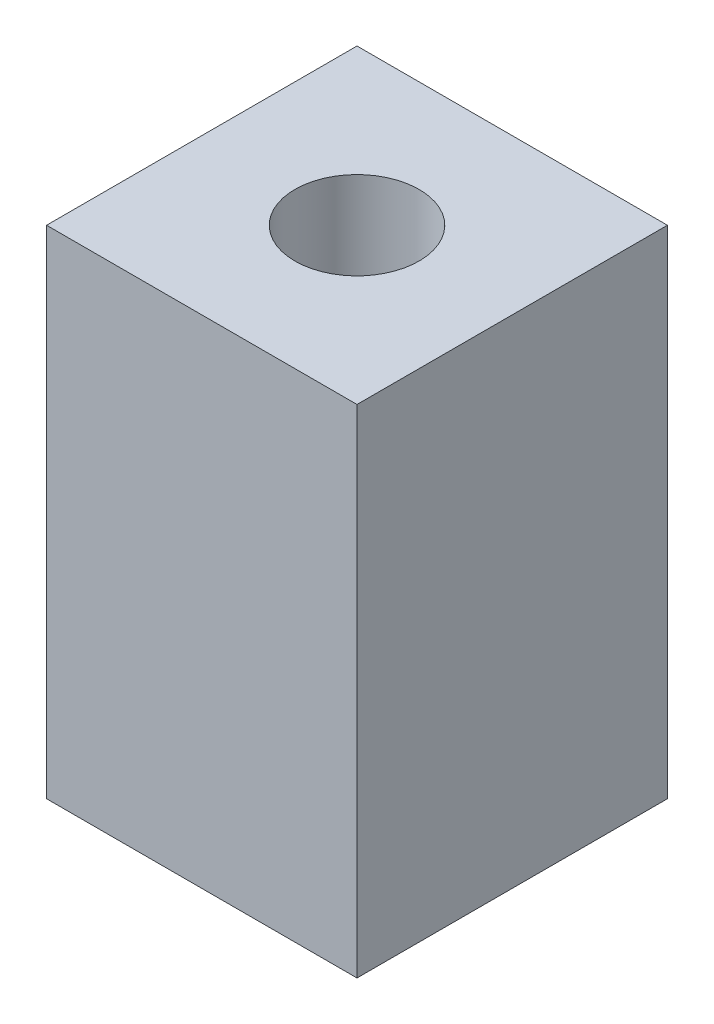
ISO-10303-21;
HEADER;
FILE_DESCRIPTION(('STEP AP214'),'2;1');
FILE_NAME('part.step','',(''),(''),'','','');
FILE_SCHEMA(('AUTOMOTIVE_DESIGN { 1 0 10303 214 1 1 1 1 }'));
ENDSEC;
DATA;
#1=APPLICATION_CONTEXT('core data for automotive mechanical design processes');
#2=APPLICATION_PROTOCOL_DEFINITION('international standard','automotive_design',2000,#1);
#3=PRODUCT_CONTEXT('',#1,'mechanical');
#4=PRODUCT('Part','Part','',(#3));
#5=PRODUCT_RELATED_PRODUCT_CATEGORY('part','',(#4));
#6=PRODUCT_DEFINITION_FORMATION('','',#4);
#7=PRODUCT_DEFINITION_CONTEXT('part definition',#1,'design');
#8=PRODUCT_DEFINITION('design','',#6,#7);
#9=PRODUCT_DEFINITION_SHAPE('','',#8);
#10=(LENGTH_UNIT() NAMED_UNIT(*) SI_UNIT(.MILLI.,.METRE.));
#11=(NAMED_UNIT(*) PLANE_ANGLE_UNIT() SI_UNIT($,.RADIAN.));
#12=(NAMED_UNIT(*) SI_UNIT($,.STERADIAN.) SOLID_ANGLE_UNIT());
#13=UNCERTAINTY_MEASURE_WITH_UNIT(LENGTH_MEASURE(1.E-05),#10,'distance_accuracy_value','');
#14=(GEOMETRIC_REPRESENTATION_CONTEXT(3) GLOBAL_UNCERTAINTY_ASSIGNED_CONTEXT((#13)) GLOBAL_UNIT_ASSIGNED_CONTEXT((#10,
#11,#12)) REPRESENTATION_CONTEXT('',''));
#15=CARTESIAN_POINT('',(0.,0.,0.));
#16=DIRECTION('',(0.,0.,1.));
#17=DIRECTION('',(1.,0.,0.));
#18=AXIS2_PLACEMENT_3D('',#15,#16,#17);
#19=CARTESIAN_POINT('',(0.,10.16,0.));
#20=DIRECTION('',(0.,1.,0.));
#21=DIRECTION('',(0.,0.,1.));
#22=AXIS2_PLACEMENT_3D('',#19,#20,#21);
#23=PLANE('',#22);
#24=DIRECTION('',(0.,0.,1.));
#25=VECTOR('',#24,1.);
#26=CARTESIAN_POINT('',(54.61,10.16,-6.35));
#27=LINE('',#26,#25);
#28=CARTESIAN_POINT('',(54.61,10.16,-6.35));
#29=VERTEX_POINT('',#28);
#30=CARTESIAN_POINT('',(54.61,10.16,6.35));
#31=VERTEX_POINT('',#30);
#32=EDGE_CURVE('E137',#29,#31,#27,.T.);
#33=ORIENTED_EDGE('',*,*,#32,.T.);
#34=DIRECTION('',(1.,0.,0.));
#35=VECTOR('',#34,1.);
#36=CARTESIAN_POINT('',(54.61,10.16,6.35));
#37=LINE('',#36,#35);
#38=CARTESIAN_POINT('',(67.31,10.16,6.35));
#39=VERTEX_POINT('',#38);
#40=EDGE_CURVE('E111',#31,#39,#37,.T.);
#41=ORIENTED_EDGE('',*,*,#40,.T.);
#42=DIRECTION('',(0.,0.,-1.));
#43=VECTOR('',#42,1.);
#44=CARTESIAN_POINT('',(67.31,10.16,6.35));
#45=LINE('',#44,#43);
#46=CARTESIAN_POINT('',(67.31,10.16,-6.35));
#47=VERTEX_POINT('',#46);
#48=EDGE_CURVE('E87',#39,#47,#45,.T.);
#49=ORIENTED_EDGE('',*,*,#48,.T.);
#50=DIRECTION('',(-1.,0.,0.));
#51=VECTOR('',#50,1.);
#52=CARTESIAN_POINT('',(67.31,10.16,-6.35));
#53=LINE('',#52,#51);
#54=EDGE_CURVE('E82',#47,#29,#53,.T.);
#55=ORIENTED_EDGE('',*,*,#54,.T.);
#56=EDGE_LOOP('',(#33,#41,#49,#55));
#57=FACE_BOUND('',#56,.T.);
#58=CARTESIAN_POINT('',(60.96,10.16,0.));
#59=DIRECTION('',(0.,1.,0.));
#60=DIRECTION('',(0.,0.,1.));
#61=AXIS2_PLACEMENT_3D('',#58,#59,#60);
#62=CIRCLE('',#61,2.53999999999999);
#63=CARTESIAN_POINT('',(60.96,10.16,2.53999999999999));
#64=VERTEX_POINT('',#63);
#65=EDGE_CURVE('E134',#64,#64,#62,.T.);
#66=ORIENTED_EDGE('',*,*,#65,.F.);
#67=EDGE_LOOP('',(#66));
#68=FACE_BOUND('',#67,.T.);
#69=ADVANCED_FACE('F67',(#57,#68),#23,.T.);
#70=CARTESIAN_POINT('',(54.61,10.16,-6.35));
#71=DIRECTION('',(1.,0.,0.));
#72=DIRECTION('',(0.,0.,-1.));
#73=AXIS2_PLACEMENT_3D('',#70,#71,#72);
#74=PLANE('',#73);
#75=DIRECTION('',(0.,-1.,0.));
#76=VECTOR('',#75,1.);
#77=CARTESIAN_POINT('',(54.61,10.16,-6.35));
#78=LINE('',#77,#76);
#79=CARTESIAN_POINT('',(54.61,-10.16,-6.35));
#80=VERTEX_POINT('',#79);
#81=EDGE_CURVE('E125',#29,#80,#78,.T.);
#82=ORIENTED_EDGE('',*,*,#81,.T.);
#83=DIRECTION('',(0.,0.,1.));
#84=VECTOR('',#83,1.);
#85=CARTESIAN_POINT('',(54.61,-10.16,-6.35));
#86=LINE('',#85,#84);
#87=CARTESIAN_POINT('',(54.61,-10.16,6.35));
#88=VERTEX_POINT('',#87);
#89=EDGE_CURVE('E120',#80,#88,#86,.T.);
#90=ORIENTED_EDGE('',*,*,#89,.T.);
#91=DIRECTION('',(0.,-1.,0.));
#92=VECTOR('',#91,1.);
#93=CARTESIAN_POINT('',(54.61,10.16,6.35));
#94=LINE('',#93,#92);
#95=EDGE_CURVE('E12',#31,#88,#94,.T.);
#96=ORIENTED_EDGE('',*,*,#95,.F.);
#97=ORIENTED_EDGE('',*,*,#32,.F.);
#98=EDGE_LOOP('',(#82,#90,#96,#97));
#99=FACE_BOUND('',#98,.T.);
#100=ADVANCED_FACE('F69',(#99),#74,.F.);
#101=CARTESIAN_POINT('',(54.61,10.16,6.35));
#102=DIRECTION('',(0.,0.,-1.));
#103=DIRECTION('',(-1.,0.,0.));
#104=AXIS2_PLACEMENT_3D('',#101,#102,#103);
#105=PLANE('',#104);
#106=ORIENTED_EDGE('',*,*,#95,.T.);
#107=DIRECTION('',(1.,0.,0.));
#108=VECTOR('',#107,1.);
#109=CARTESIAN_POINT('',(54.61,-10.16,6.35));
#110=LINE('',#109,#108);
#111=CARTESIAN_POINT('',(67.31,-10.16,6.35));
#112=VERTEX_POINT('',#111);
#113=EDGE_CURVE('E110',#88,#112,#110,.T.);
#114=ORIENTED_EDGE('',*,*,#113,.T.);
#115=DIRECTION('',(0.,-1.,0.));
#116=VECTOR('',#115,1.);
#117=CARTESIAN_POINT('',(67.31,10.16,6.35));
#118=LINE('',#117,#116);
#119=EDGE_CURVE('E75',#39,#112,#118,.T.);
#120=ORIENTED_EDGE('',*,*,#119,.F.);
#121=ORIENTED_EDGE('',*,*,#40,.F.);
#122=EDGE_LOOP('',(#106,#114,#120,#121));
#123=FACE_BOUND('',#122,.T.);
#124=ADVANCED_FACE('F108',(#123),#105,.F.);
#125=CARTESIAN_POINT('',(67.31,10.16,6.35));
#126=DIRECTION('',(-1.,0.,0.));
#127=DIRECTION('',(0.,0.,1.));
#128=AXIS2_PLACEMENT_3D('',#125,#126,#127);
#129=PLANE('',#128);
#130=ORIENTED_EDGE('',*,*,#119,.T.);
#131=DIRECTION('',(0.,0.,-1.));
#132=VECTOR('',#131,1.);
#133=CARTESIAN_POINT('',(67.31,-10.16,6.35));
#134=LINE('',#133,#132);
#135=CARTESIAN_POINT('',(67.31,-10.16,-6.35));
#136=VERTEX_POINT('',#135);
#137=EDGE_CURVE('E123',#112,#136,#134,.T.);
#138=ORIENTED_EDGE('',*,*,#137,.T.);
#139=DIRECTION('',(0.,-1.,0.));
#140=VECTOR('',#139,1.);
#141=CARTESIAN_POINT('',(67.31,10.16,-6.35));
#142=LINE('',#141,#140);
#143=EDGE_CURVE('E143',#47,#136,#142,.T.);
#144=ORIENTED_EDGE('',*,*,#143,.F.);
#145=ORIENTED_EDGE('',*,*,#48,.F.);
#146=EDGE_LOOP('',(#130,#138,#144,#145));
#147=FACE_BOUND('',#146,.T.);
#148=ADVANCED_FACE('F145',(#147),#129,.F.);
#149=CARTESIAN_POINT('',(67.31,10.16,-6.35));
#150=DIRECTION('',(0.,0.,1.));
#151=DIRECTION('',(1.,0.,0.));
#152=AXIS2_PLACEMENT_3D('',#149,#150,#151);
#153=PLANE('',#152);
#154=ORIENTED_EDGE('',*,*,#143,.T.);
#155=DIRECTION('',(-1.,0.,0.));
#156=VECTOR('',#155,1.);
#157=CARTESIAN_POINT('',(67.31,-10.16,-6.35));
#158=LINE('',#157,#156);
#159=EDGE_CURVE('E132',#136,#80,#158,.T.);
#160=ORIENTED_EDGE('',*,*,#159,.T.);
#161=ORIENTED_EDGE('',*,*,#81,.F.);
#162=ORIENTED_EDGE('',*,*,#54,.F.);
#163=EDGE_LOOP('',(#154,#160,#161,#162));
#164=FACE_BOUND('',#163,.T.);
#165=ADVANCED_FACE('F147',(#164),#153,.F.);
#166=CARTESIAN_POINT('',(60.96,10.16,0.));
#167=DIRECTION('',(0.,-1.,0.));
#168=DIRECTION('',(0.,0.,-1.));
#169=AXIS2_PLACEMENT_3D('',#166,#167,#168);
#170=CYLINDRICAL_SURFACE('',#169,2.53999999999999);
#171=ORIENTED_EDGE('',*,*,#65,.T.);
#172=EDGE_LOOP('',(#171));
#173=FACE_BOUND('',#172,.T.);
#174=CARTESIAN_POINT('',(60.96,-10.16,0.));
#175=DIRECTION('',(0.,1.,0.));
#176=DIRECTION('',(0.,0.,1.));
#177=AXIS2_PLACEMENT_3D('',#174,#175,#176);
#178=CIRCLE('',#177,2.53999999999999);
#179=CARTESIAN_POINT('',(60.96,-10.16,2.53999999999999));
#180=VERTEX_POINT('',#179);
#181=EDGE_CURVE('E126',#180,#180,#178,.T.);
#182=ORIENTED_EDGE('',*,*,#181,.F.);
#183=EDGE_LOOP('',(#182));
#184=FACE_BOUND('',#183,.T.);
#185=ADVANCED_FACE('F153',(#173,#184),#170,.F.);
#186=CARTESIAN_POINT('',(0.,-10.16,0.));
#187=DIRECTION('',(0.,1.,0.));
#188=DIRECTION('',(0.,0.,1.));
#189=AXIS2_PLACEMENT_3D('',#186,#187,#188);
#190=PLANE('',#189);
#191=ORIENTED_EDGE('',*,*,#181,.T.);
#192=EDGE_LOOP('',(#191));
#193=FACE_BOUND('',#192,.T.);
#194=ORIENTED_EDGE('',*,*,#89,.F.);
#195=ORIENTED_EDGE('',*,*,#159,.F.);
#196=ORIENTED_EDGE('',*,*,#137,.F.);
#197=ORIENTED_EDGE('',*,*,#113,.F.);
#198=EDGE_LOOP('',(#194,#195,#196,#197));
#199=FACE_BOUND('',#198,.T.);
#200=ADVANCED_FACE('F118',(#193,#199),#190,.F.);
#201=CLOSED_SHELL('',(#69,#100,#124,#148,#165,#185,#200));
#202=MANIFOLD_SOLID_BREP('B2',#201);
#203=ADVANCED_BREP_SHAPE_REPRESENTATION('',(#18,#202),#14);
#204=SHAPE_DEFINITION_REPRESENTATION(#9,#203);
ENDSEC;
END-ISO-10303-21;
